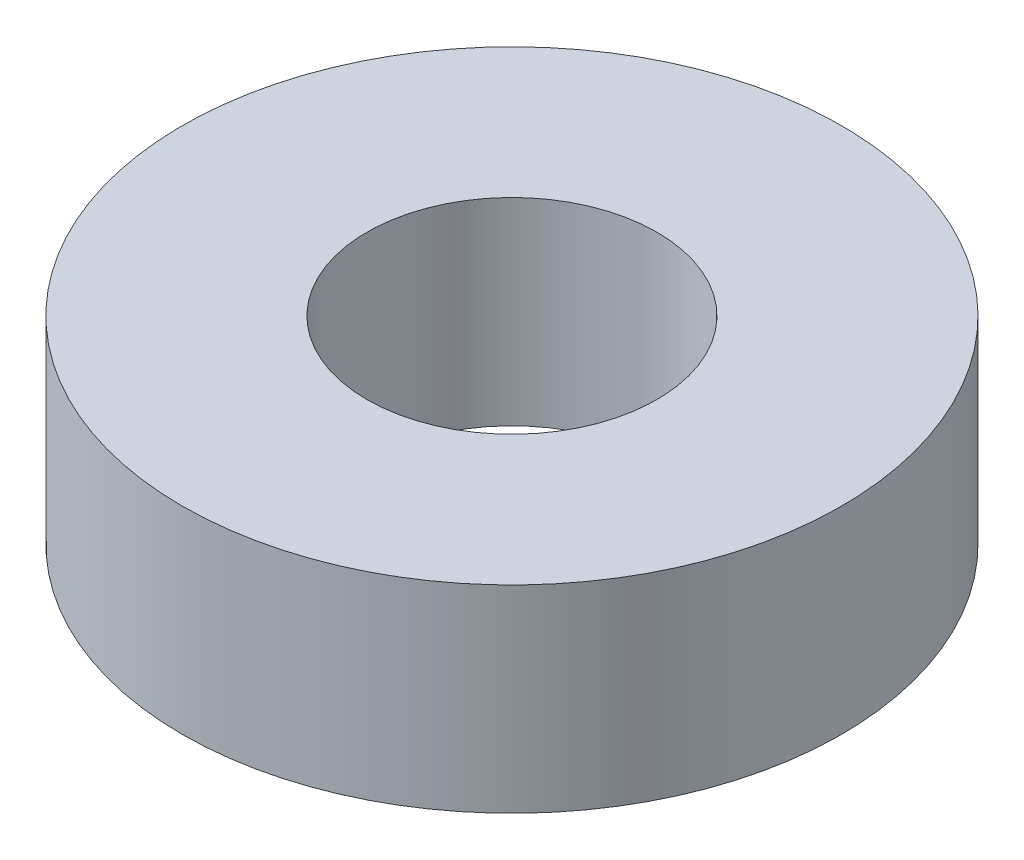
ISO-10303-21;
HEADER;
FILE_DESCRIPTION(('STEP AP214'),'2;1');
FILE_NAME('part.step','',(''),(''),'','','');
FILE_SCHEMA(('AUTOMOTIVE_DESIGN { 1 0 10303 214 1 1 1 1 }'));
ENDSEC;
DATA;
#1=APPLICATION_CONTEXT('core data for automotive mechanical design processes');
#2=APPLICATION_PROTOCOL_DEFINITION('international standard','automotive_design',2000,#1);
#3=PRODUCT_CONTEXT('',#1,'mechanical');
#4=PRODUCT('Part','Part','',(#3));
#5=PRODUCT_RELATED_PRODUCT_CATEGORY('part','',(#4));
#6=PRODUCT_DEFINITION_FORMATION('','',#4);
#7=PRODUCT_DEFINITION_CONTEXT('part definition',#1,'design');
#8=PRODUCT_DEFINITION('design','',#6,#7);
#9=PRODUCT_DEFINITION_SHAPE('','',#8);
#10=(LENGTH_UNIT() NAMED_UNIT(*) SI_UNIT(.MILLI.,.METRE.));
#11=(NAMED_UNIT(*) PLANE_ANGLE_UNIT() SI_UNIT($,.RADIAN.));
#12=(NAMED_UNIT(*) SI_UNIT($,.STERADIAN.) SOLID_ANGLE_UNIT());
#13=UNCERTAINTY_MEASURE_WITH_UNIT(LENGTH_MEASURE(1.E-05),#10,'distance_accuracy_value','');
#14=(GEOMETRIC_REPRESENTATION_CONTEXT(3) GLOBAL_UNCERTAINTY_ASSIGNED_CONTEXT((#13)) GLOBAL_UNIT_ASSIGNED_CONTEXT((#10,
#11,#12)) REPRESENTATION_CONTEXT('',''));
#15=CARTESIAN_POINT('',(0.,0.,0.));
#16=DIRECTION('',(0.,0.,1.));
#17=DIRECTION('',(1.,0.,0.));
#18=AXIS2_PLACEMENT_3D('',#15,#16,#17);
#19=CARTESIAN_POINT('',(0.,3.,0.));
#20=DIRECTION('',(0.,1.,0.));
#21=DIRECTION('',(0.,0.,1.));
#22=AXIS2_PLACEMENT_3D('',#19,#20,#21);
#23=PLANE('',#22);
#24=CARTESIAN_POINT('',(0.,3.,0.));
#25=DIRECTION('',(0.,1.,0.));
#26=DIRECTION('',(0.,0.,1.));
#27=AXIS2_PLACEMENT_3D('',#24,#25,#26);
#28=CIRCLE('',#27,5.);
#29=CARTESIAN_POINT('',(0.,3.,5.));
#30=VERTEX_POINT('',#29);
#31=EDGE_CURVE('E10',#30,#30,#28,.T.);
#32=ORIENTED_EDGE('',*,*,#31,.T.);
#33=EDGE_LOOP('',(#32));
#34=FACE_BOUND('',#33,.T.);
#35=CARTESIAN_POINT('',(0.,3.,0.));
#36=DIRECTION('',(0.,1.,0.));
#37=DIRECTION('',(0.,0.,1.));
#38=AXIS2_PLACEMENT_3D('',#35,#36,#37);
#39=CIRCLE('',#38,2.2);
#40=CARTESIAN_POINT('',(0.,3.,2.2));
#41=VERTEX_POINT('',#40);
#42=EDGE_CURVE('E56',#41,#41,#39,.T.);
#43=ORIENTED_EDGE('',*,*,#42,.F.);
#44=EDGE_LOOP('',(#43));
#45=FACE_BOUND('',#44,.T.);
#46=ADVANCED_FACE('F43',(#34,#45),#23,.T.);
#47=CARTESIAN_POINT('',(0.,0.,0.));
#48=DIRECTION('',(0.,1.,0.));
#49=DIRECTION('',(0.,0.,1.));
#50=AXIS2_PLACEMENT_3D('',#47,#48,#49);
#51=PLANE('',#50);
#52=CARTESIAN_POINT('',(0.,0.,0.));
#53=DIRECTION('',(0.,1.,0.));
#54=DIRECTION('',(0.,0.,1.));
#55=AXIS2_PLACEMENT_3D('',#52,#53,#54);
#56=CIRCLE('',#55,5.);
#57=CARTESIAN_POINT('',(0.,0.,5.));
#58=VERTEX_POINT('',#57);
#59=EDGE_CURVE('E47',#58,#58,#56,.T.);
#60=ORIENTED_EDGE('',*,*,#59,.F.);
#61=EDGE_LOOP('',(#60));
#62=FACE_BOUND('',#61,.T.);
#63=CARTESIAN_POINT('',(0.,0.,0.));
#64=DIRECTION('',(0.,1.,0.));
#65=DIRECTION('',(0.,0.,1.));
#66=AXIS2_PLACEMENT_3D('',#63,#64,#65);
#67=CIRCLE('',#66,2.2);
#68=CARTESIAN_POINT('',(0.,0.,2.2));
#69=VERTEX_POINT('',#68);
#70=EDGE_CURVE('E58',#69,#69,#67,.T.);
#71=ORIENTED_EDGE('',*,*,#70,.T.);
#72=EDGE_LOOP('',(#71));
#73=FACE_BOUND('',#72,.T.);
#74=ADVANCED_FACE('F70',(#62,#73),#51,.F.);
#75=CARTESIAN_POINT('',(0.,3.,0.));
#76=DIRECTION('',(0.,-1.,0.));
#77=DIRECTION('',(0.,0.,-1.));
#78=AXIS2_PLACEMENT_3D('',#75,#76,#77);
#79=CYLINDRICAL_SURFACE('',#78,5.);
#80=ORIENTED_EDGE('',*,*,#31,.F.);
#81=EDGE_LOOP('',(#80));
#82=FACE_BOUND('',#81,.T.);
#83=ORIENTED_EDGE('',*,*,#59,.T.);
#84=EDGE_LOOP('',(#83));
#85=FACE_BOUND('',#84,.T.);
#86=ADVANCED_FACE('F45',(#82,#85),#79,.T.);
#87=CARTESIAN_POINT('',(0.,3.,0.));
#88=DIRECTION('',(0.,-1.,0.));
#89=DIRECTION('',(0.,0.,-1.));
#90=AXIS2_PLACEMENT_3D('',#87,#88,#89);
#91=CYLINDRICAL_SURFACE('',#90,2.2);
#92=ORIENTED_EDGE('',*,*,#42,.T.);
#93=EDGE_LOOP('',(#92));
#94=FACE_BOUND('',#93,.T.);
#95=ORIENTED_EDGE('',*,*,#70,.F.);
#96=EDGE_LOOP('',(#95));
#97=FACE_BOUND('',#96,.T.);
#98=ADVANCED_FACE('F66',(#94,#97),#91,.F.);
#99=CLOSED_SHELL('',(#46,#74,#86,#98));
#100=MANIFOLD_SOLID_BREP('B2',#99);
#101=ADVANCED_BREP_SHAPE_REPRESENTATION('',(#18,#100),#14);
#102=SHAPE_DEFINITION_REPRESENTATION(#9,#101);
ENDSEC;
END-ISO-10303-21;
